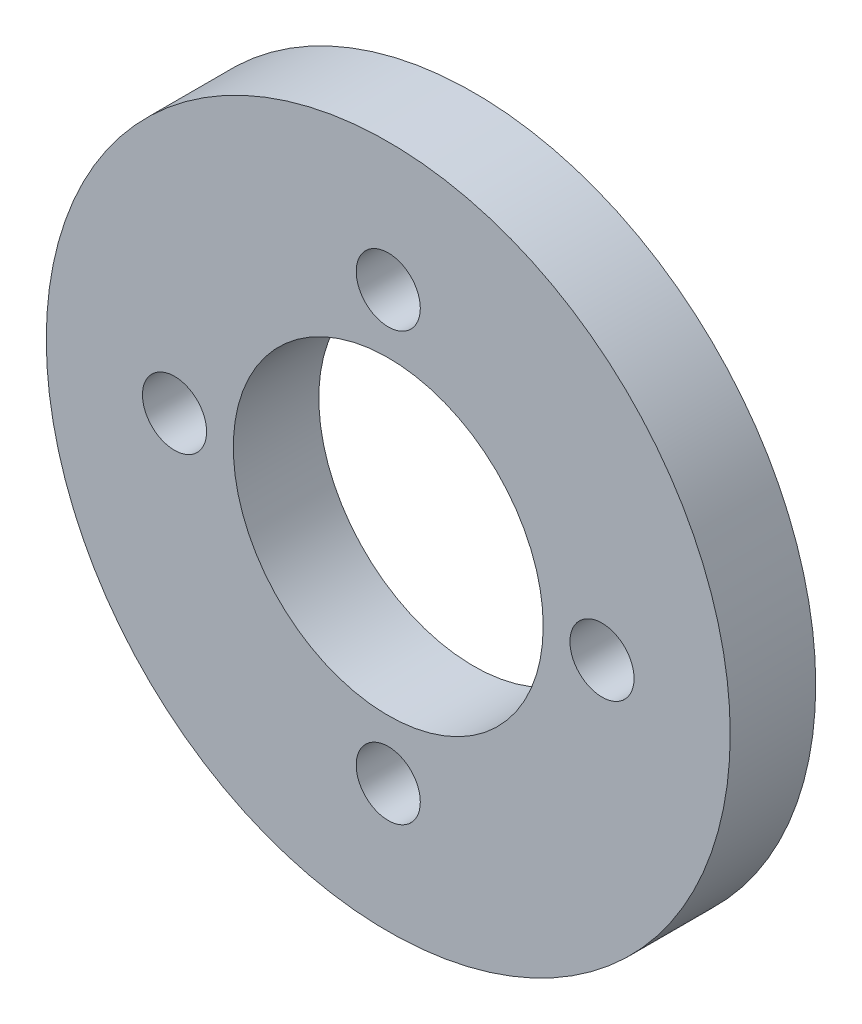
ISO-10303-21;
HEADER;
FILE_DESCRIPTION(('STEP AP214'),'2;1');
FILE_NAME('part.step','',(''),(''),'','','');
FILE_SCHEMA(('AUTOMOTIVE_DESIGN { 1 0 10303 214 1 1 1 1 }'));
ENDSEC;
DATA;
#1=APPLICATION_CONTEXT('core data for automotive mechanical design processes');
#2=APPLICATION_PROTOCOL_DEFINITION('international standard','automotive_design',2000,#1);
#3=PRODUCT_CONTEXT('',#1,'mechanical');
#4=PRODUCT('Part','Part','',(#3));
#5=PRODUCT_RELATED_PRODUCT_CATEGORY('part','',(#4));
#6=PRODUCT_DEFINITION_FORMATION('','',#4);
#7=PRODUCT_DEFINITION_CONTEXT('part definition',#1,'design');
#8=PRODUCT_DEFINITION('design','',#6,#7);
#9=PRODUCT_DEFINITION_SHAPE('','',#8);
#10=(LENGTH_UNIT() NAMED_UNIT(*) SI_UNIT(.MILLI.,.METRE.));
#11=(NAMED_UNIT(*) PLANE_ANGLE_UNIT() SI_UNIT($,.RADIAN.));
#12=(NAMED_UNIT(*) SI_UNIT($,.STERADIAN.) SOLID_ANGLE_UNIT());
#13=UNCERTAINTY_MEASURE_WITH_UNIT(LENGTH_MEASURE(1.E-05),#10,'distance_accuracy_value','');
#14=(GEOMETRIC_REPRESENTATION_CONTEXT(3) GLOBAL_UNCERTAINTY_ASSIGNED_CONTEXT((#13)) GLOBAL_UNIT_ASSIGNED_CONTEXT((#10,
#11,#12)) REPRESENTATION_CONTEXT('',''));
#15=CARTESIAN_POINT('',(0.,0.,0.));
#16=DIRECTION('',(0.,0.,1.));
#17=DIRECTION('',(1.,0.,0.));
#18=AXIS2_PLACEMENT_3D('',#15,#16,#17);
#19=CARTESIAN_POINT('',(0.,0.,4.));
#20=DIRECTION('',(0.,0.,1.));
#21=DIRECTION('',(1.,0.,0.));
#22=AXIS2_PLACEMENT_3D('',#19,#20,#21);
#23=PLANE('',#22);
#24=CARTESIAN_POINT('',(0.,-10.,4.));
#25=DIRECTION('',(0.,0.,1.));
#26=DIRECTION('',(1.,0.,0.));
#27=AXIS2_PLACEMENT_3D('',#24,#25,#26);
#28=CIRCLE('',#27,1.50000000000007);
#29=CARTESIAN_POINT('',(1.50000000000007,-10.,4.));
#30=VERTEX_POINT('',#29);
#31=EDGE_CURVE('E62',#30,#30,#28,.T.);
#32=ORIENTED_EDGE('',*,*,#31,.F.);
#33=EDGE_LOOP('',(#32));
#34=FACE_BOUND('',#33,.T.);
#35=CARTESIAN_POINT('',(0.,10.,4.));
#36=DIRECTION('',(0.,0.,1.));
#37=DIRECTION('',(1.,0.,0.));
#38=AXIS2_PLACEMENT_3D('',#35,#36,#37);
#39=CIRCLE('',#38,1.5);
#40=CARTESIAN_POINT('',(1.5,10.,4.));
#41=VERTEX_POINT('',#40);
#42=EDGE_CURVE('E50',#41,#41,#39,.T.);
#43=ORIENTED_EDGE('',*,*,#42,.F.);
#44=EDGE_LOOP('',(#43));
#45=FACE_BOUND('',#44,.T.);
#46=CARTESIAN_POINT('',(0.,0.,4.));
#47=DIRECTION('',(0.,0.,1.));
#48=DIRECTION('',(1.,0.,0.));
#49=AXIS2_PLACEMENT_3D('',#46,#47,#48);
#50=CIRCLE('',#49,16.);
#51=CARTESIAN_POINT('',(16.,0.,4.));
#52=VERTEX_POINT('',#51);
#53=EDGE_CURVE('E10',#52,#52,#50,.T.);
#54=ORIENTED_EDGE('',*,*,#53,.T.);
#55=EDGE_LOOP('',(#54));
#56=FACE_BOUND('',#55,.T.);
#57=CARTESIAN_POINT('',(0.,0.,4.));
#58=DIRECTION('',(0.,0.,1.));
#59=DIRECTION('',(1.,0.,0.));
#60=AXIS2_PLACEMENT_3D('',#57,#58,#59);
#61=CIRCLE('',#60,7.25);
#62=CARTESIAN_POINT('',(7.25,0.,4.));
#63=VERTEX_POINT('',#62);
#64=EDGE_CURVE('E45',#63,#63,#61,.T.);
#65=ORIENTED_EDGE('',*,*,#64,.F.);
#66=EDGE_LOOP('',(#65));
#67=FACE_BOUND('',#66,.T.);
#68=CARTESIAN_POINT('',(10.,0.,4.));
#69=DIRECTION('',(0.,0.,1.));
#70=DIRECTION('',(1.,0.,0.));
#71=AXIS2_PLACEMENT_3D('',#68,#69,#70);
#72=CIRCLE('',#71,1.50000000000003);
#73=CARTESIAN_POINT('',(11.5,0.,4.));
#74=VERTEX_POINT('',#73);
#75=EDGE_CURVE('E56',#74,#74,#72,.T.);
#76=ORIENTED_EDGE('',*,*,#75,.F.);
#77=EDGE_LOOP('',(#76));
#78=FACE_BOUND('',#77,.T.);
#79=CARTESIAN_POINT('',(-10.,0.,4.));
#80=DIRECTION('',(0.,0.,1.));
#81=DIRECTION('',(1.,0.,0.));
#82=AXIS2_PLACEMENT_3D('',#79,#80,#81);
#83=CIRCLE('',#82,1.5000000000001);
#84=CARTESIAN_POINT('',(-8.4999999999999,0.,4.));
#85=VERTEX_POINT('',#84);
#86=EDGE_CURVE('E68',#85,#85,#83,.T.);
#87=ORIENTED_EDGE('',*,*,#86,.F.);
#88=EDGE_LOOP('',(#87));
#89=FACE_BOUND('',#88,.T.);
#90=ADVANCED_FACE('F34',(#34,#45,#56,#67,#78,#89),#23,.T.);
#91=CARTESIAN_POINT('',(0.,0.,0.));
#92=DIRECTION('',(0.,0.,1.));
#93=DIRECTION('',(1.,0.,0.));
#94=AXIS2_PLACEMENT_3D('',#91,#92,#93);
#95=PLANE('',#94);
#96=CARTESIAN_POINT('',(0.,0.,0.));
#97=DIRECTION('',(0.,0.,1.));
#98=DIRECTION('',(1.,0.,0.));
#99=AXIS2_PLACEMENT_3D('',#96,#97,#98);
#100=CIRCLE('',#99,16.);
#101=CARTESIAN_POINT('',(16.,0.,0.));
#102=VERTEX_POINT('',#101);
#103=EDGE_CURVE('E38',#102,#102,#100,.T.);
#104=ORIENTED_EDGE('',*,*,#103,.F.);
#105=EDGE_LOOP('',(#104));
#106=FACE_BOUND('',#105,.T.);
#107=CARTESIAN_POINT('',(0.,0.,0.));
#108=DIRECTION('',(0.,0.,1.));
#109=DIRECTION('',(1.,0.,0.));
#110=AXIS2_PLACEMENT_3D('',#107,#108,#109);
#111=CIRCLE('',#110,7.25);
#112=CARTESIAN_POINT('',(7.25,0.,0.));
#113=VERTEX_POINT('',#112);
#114=EDGE_CURVE('E47',#113,#113,#111,.T.);
#115=ORIENTED_EDGE('',*,*,#114,.T.);
#116=EDGE_LOOP('',(#115));
#117=FACE_BOUND('',#116,.T.);
#118=CARTESIAN_POINT('',(0.,10.,0.));
#119=DIRECTION('',(0.,0.,1.));
#120=DIRECTION('',(1.,0.,0.));
#121=AXIS2_PLACEMENT_3D('',#118,#119,#120);
#122=CIRCLE('',#121,1.5);
#123=CARTESIAN_POINT('',(1.5,10.,0.));
#124=VERTEX_POINT('',#123);
#125=EDGE_CURVE('E53',#124,#124,#122,.T.);
#126=ORIENTED_EDGE('',*,*,#125,.T.);
#127=EDGE_LOOP('',(#126));
#128=FACE_BOUND('',#127,.T.);
#129=CARTESIAN_POINT('',(10.,0.,0.));
#130=DIRECTION('',(0.,0.,1.));
#131=DIRECTION('',(1.,0.,0.));
#132=AXIS2_PLACEMENT_3D('',#129,#130,#131);
#133=CIRCLE('',#132,1.50000000000003);
#134=CARTESIAN_POINT('',(11.5,0.,0.));
#135=VERTEX_POINT('',#134);
#136=EDGE_CURVE('E59',#135,#135,#133,.T.);
#137=ORIENTED_EDGE('',*,*,#136,.T.);
#138=EDGE_LOOP('',(#137));
#139=FACE_BOUND('',#138,.T.);
#140=CARTESIAN_POINT('',(0.,-10.,0.));
#141=DIRECTION('',(0.,0.,1.));
#142=DIRECTION('',(1.,0.,0.));
#143=AXIS2_PLACEMENT_3D('',#140,#141,#142);
#144=CIRCLE('',#143,1.50000000000007);
#145=CARTESIAN_POINT('',(1.50000000000007,-10.,0.));
#146=VERTEX_POINT('',#145);
#147=EDGE_CURVE('E65',#146,#146,#144,.T.);
#148=ORIENTED_EDGE('',*,*,#147,.T.);
#149=EDGE_LOOP('',(#148));
#150=FACE_BOUND('',#149,.T.);
#151=CARTESIAN_POINT('',(-10.,0.,0.));
#152=DIRECTION('',(0.,0.,1.));
#153=DIRECTION('',(1.,0.,0.));
#154=AXIS2_PLACEMENT_3D('',#151,#152,#153);
#155=CIRCLE('',#154,1.5000000000001);
#156=CARTESIAN_POINT('',(-8.4999999999999,0.,0.));
#157=VERTEX_POINT('',#156);
#158=EDGE_CURVE('E71',#157,#157,#155,.T.);
#159=ORIENTED_EDGE('',*,*,#158,.T.);
#160=EDGE_LOOP('',(#159));
#161=FACE_BOUND('',#160,.T.);
#162=ADVANCED_FACE('F81',(#106,#117,#128,#139,#150,#161),#95,.F.);
#163=CARTESIAN_POINT('',(0.,0.,4.));
#164=DIRECTION('',(0.,0.,-1.));
#165=DIRECTION('',(-1.,0.,0.));
#166=AXIS2_PLACEMENT_3D('',#163,#164,#165);
#167=CYLINDRICAL_SURFACE('',#166,16.);
#168=ORIENTED_EDGE('',*,*,#53,.F.);
#169=EDGE_LOOP('',(#168));
#170=FACE_BOUND('',#169,.T.);
#171=ORIENTED_EDGE('',*,*,#103,.T.);
#172=EDGE_LOOP('',(#171));
#173=FACE_BOUND('',#172,.T.);
#174=ADVANCED_FACE('F36',(#170,#173),#167,.T.);
#175=CARTESIAN_POINT('',(0.,0.,4.));
#176=DIRECTION('',(0.,0.,-1.));
#177=DIRECTION('',(-1.,0.,0.));
#178=AXIS2_PLACEMENT_3D('',#175,#176,#177);
#179=CYLINDRICAL_SURFACE('',#178,7.25);
#180=ORIENTED_EDGE('',*,*,#64,.T.);
#181=EDGE_LOOP('',(#180));
#182=FACE_BOUND('',#181,.T.);
#183=ORIENTED_EDGE('',*,*,#114,.F.);
#184=EDGE_LOOP('',(#183));
#185=FACE_BOUND('',#184,.T.);
#186=ADVANCED_FACE('F91',(#182,#185),#179,.F.);
#187=CARTESIAN_POINT('',(0.,10.,4.));
#188=DIRECTION('',(0.,0.,-1.));
#189=DIRECTION('',(-1.,0.,0.));
#190=AXIS2_PLACEMENT_3D('',#187,#188,#189);
#191=CYLINDRICAL_SURFACE('',#190,1.5);
#192=ORIENTED_EDGE('',*,*,#42,.T.);
#193=EDGE_LOOP('',(#192));
#194=FACE_BOUND('',#193,.T.);
#195=ORIENTED_EDGE('',*,*,#125,.F.);
#196=EDGE_LOOP('',(#195));
#197=FACE_BOUND('',#196,.T.);
#198=ADVANCED_FACE('F94',(#194,#197),#191,.F.);
#199=CARTESIAN_POINT('',(10.,0.,4.));
#200=DIRECTION('',(0.,0.,-1.));
#201=DIRECTION('',(-1.,0.,0.));
#202=AXIS2_PLACEMENT_3D('',#199,#200,#201);
#203=CYLINDRICAL_SURFACE('',#202,1.50000000000003);
#204=ORIENTED_EDGE('',*,*,#75,.T.);
#205=EDGE_LOOP('',(#204));
#206=FACE_BOUND('',#205,.T.);
#207=ORIENTED_EDGE('',*,*,#136,.F.);
#208=EDGE_LOOP('',(#207));
#209=FACE_BOUND('',#208,.T.);
#210=ADVANCED_FACE('F98',(#206,#209),#203,.F.);
#211=CARTESIAN_POINT('',(0.,-10.,4.));
#212=DIRECTION('',(0.,0.,-1.));
#213=DIRECTION('',(-1.,0.,0.));
#214=AXIS2_PLACEMENT_3D('',#211,#212,#213);
#215=CYLINDRICAL_SURFACE('',#214,1.50000000000007);
#216=ORIENTED_EDGE('',*,*,#31,.T.);
#217=EDGE_LOOP('',(#216));
#218=FACE_BOUND('',#217,.T.);
#219=ORIENTED_EDGE('',*,*,#147,.F.);
#220=EDGE_LOOP('',(#219));
#221=FACE_BOUND('',#220,.T.);
#222=ADVANCED_FACE('F102',(#218,#221),#215,.F.);
#223=CARTESIAN_POINT('',(-10.,0.,4.));
#224=DIRECTION('',(0.,0.,-1.));
#225=DIRECTION('',(-1.,0.,0.));
#226=AXIS2_PLACEMENT_3D('',#223,#224,#225);
#227=CYLINDRICAL_SURFACE('',#226,1.5000000000001);
#228=ORIENTED_EDGE('',*,*,#86,.T.);
#229=EDGE_LOOP('',(#228));
#230=FACE_BOUND('',#229,.T.);
#231=ORIENTED_EDGE('',*,*,#158,.F.);
#232=EDGE_LOOP('',(#231));
#233=FACE_BOUND('',#232,.T.);
#234=ADVANCED_FACE('F77',(#230,#233),#227,.F.);
#235=CLOSED_SHELL('',(#90,#162,#174,#186,#198,#210,#222,#234));
#236=MANIFOLD_SOLID_BREP('B2',#235);
#237=ADVANCED_BREP_SHAPE_REPRESENTATION('',(#18,#236),#14);
#238=SHAPE_DEFINITION_REPRESENTATION(#9,#237);
ENDSEC;
END-ISO-10303-21;
